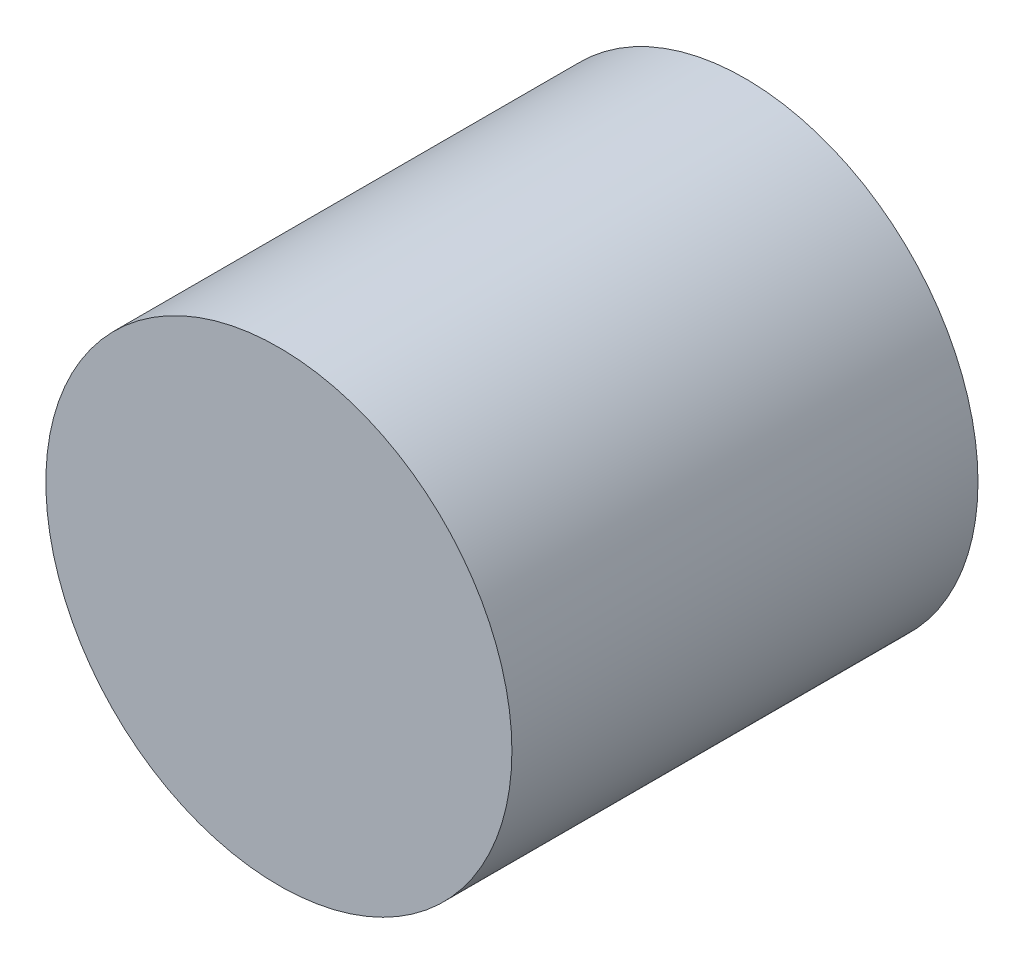
ISO-10303-21;
HEADER;
FILE_DESCRIPTION(('STEP AP214'),'2;1');
FILE_NAME('part.step','',(''),(''),'','','');
FILE_SCHEMA(('AUTOMOTIVE_DESIGN { 1 0 10303 214 1 1 1 1 }'));
ENDSEC;
DATA;
#1=APPLICATION_CONTEXT('core data for automotive mechanical design processes');
#2=APPLICATION_PROTOCOL_DEFINITION('international standard','automotive_design',2000,#1);
#3=PRODUCT_CONTEXT('',#1,'mechanical');
#4=PRODUCT('Part','Part','',(#3));
#5=PRODUCT_RELATED_PRODUCT_CATEGORY('part','',(#4));
#6=PRODUCT_DEFINITION_FORMATION('','',#4);
#7=PRODUCT_DEFINITION_CONTEXT('part definition',#1,'design');
#8=PRODUCT_DEFINITION('design','',#6,#7);
#9=PRODUCT_DEFINITION_SHAPE('','',#8);
#10=(LENGTH_UNIT() NAMED_UNIT(*) SI_UNIT(.MILLI.,.METRE.));
#11=(NAMED_UNIT(*) PLANE_ANGLE_UNIT() SI_UNIT($,.RADIAN.));
#12=(NAMED_UNIT(*) SI_UNIT($,.STERADIAN.) SOLID_ANGLE_UNIT());
#13=UNCERTAINTY_MEASURE_WITH_UNIT(LENGTH_MEASURE(1.E-05),#10,'distance_accuracy_value','');
#14=(GEOMETRIC_REPRESENTATION_CONTEXT(3) GLOBAL_UNCERTAINTY_ASSIGNED_CONTEXT((#13)) GLOBAL_UNIT_ASSIGNED_CONTEXT((#10,
#11,#12)) REPRESENTATION_CONTEXT('',''));
#15=CARTESIAN_POINT('',(0.,0.,0.));
#16=DIRECTION('',(0.,0.,1.));
#17=DIRECTION('',(1.,0.,0.));
#18=AXIS2_PLACEMENT_3D('',#15,#16,#17);
#19=CARTESIAN_POINT('',(0.,680.,3.00000000000001));
#20=DIRECTION('',(0.,0.,-1.));
#21=DIRECTION('',(-1.,0.,0.));
#22=AXIS2_PLACEMENT_3D('',#19,#20,#21);
#23=CYLINDRICAL_SURFACE('',#22,2.99999999999999);
#24=CARTESIAN_POINT('',(0.,680.,3.00000000000001));
#25=DIRECTION('',(0.,0.,1.));
#26=DIRECTION('',(1.,0.,0.));
#27=AXIS2_PLACEMENT_3D('',#24,#25,#26);
#28=CIRCLE('',#27,2.99999999999999);
#29=CARTESIAN_POINT('',(2.99999999999999,680.,3.00000000000001));
#30=VERTEX_POINT('',#29);
#31=EDGE_CURVE('E11',#30,#30,#28,.T.);
#32=ORIENTED_EDGE('',*,*,#31,.F.);
#33=EDGE_LOOP('',(#32));
#34=FACE_BOUND('',#33,.T.);
#35=CARTESIAN_POINT('',(0.,680.,-3.00000000000001));
#36=DIRECTION('',(0.,0.,1.));
#37=DIRECTION('',(1.,0.,0.));
#38=AXIS2_PLACEMENT_3D('',#35,#36,#37);
#39=CIRCLE('',#38,2.99999999999999);
#40=CARTESIAN_POINT('',(2.99999999999999,680.,-3.00000000000001));
#41=VERTEX_POINT('',#40);
#42=EDGE_CURVE('E43',#41,#41,#39,.T.);
#43=ORIENTED_EDGE('',*,*,#42,.T.);
#44=EDGE_LOOP('',(#43));
#45=FACE_BOUND('',#44,.T.);
#46=ADVANCED_FACE('F37',(#34,#45),#23,.T.);
#47=CARTESIAN_POINT('',(0.,680.,3.00000000000001));
#48=DIRECTION('',(0.,0.,1.));
#49=DIRECTION('',(1.,0.,0.));
#50=AXIS2_PLACEMENT_3D('',#47,#48,#49);
#51=PLANE('',#50);
#52=ORIENTED_EDGE('',*,*,#31,.T.);
#53=EDGE_LOOP('',(#52));
#54=FACE_BOUND('',#53,.T.);
#55=ADVANCED_FACE('F52',(#54),#51,.T.);
#56=CARTESIAN_POINT('',(0.,680.,-3.00000000000001));
#57=DIRECTION('',(0.,0.,1.));
#58=DIRECTION('',(1.,0.,0.));
#59=AXIS2_PLACEMENT_3D('',#56,#57,#58);
#60=PLANE('',#59);
#61=ORIENTED_EDGE('',*,*,#42,.F.);
#62=EDGE_LOOP('',(#61));
#63=FACE_BOUND('',#62,.T.);
#64=ADVANCED_FACE('F50',(#63),#60,.F.);
#65=CLOSED_SHELL('',(#46,#55,#64));
#66=MANIFOLD_SOLID_BREP('B2',#65);
#67=ADVANCED_BREP_SHAPE_REPRESENTATION('',(#18,#66),#14);
#68=SHAPE_DEFINITION_REPRESENTATION(#9,#67);
ENDSEC;
END-ISO-10303-21;
